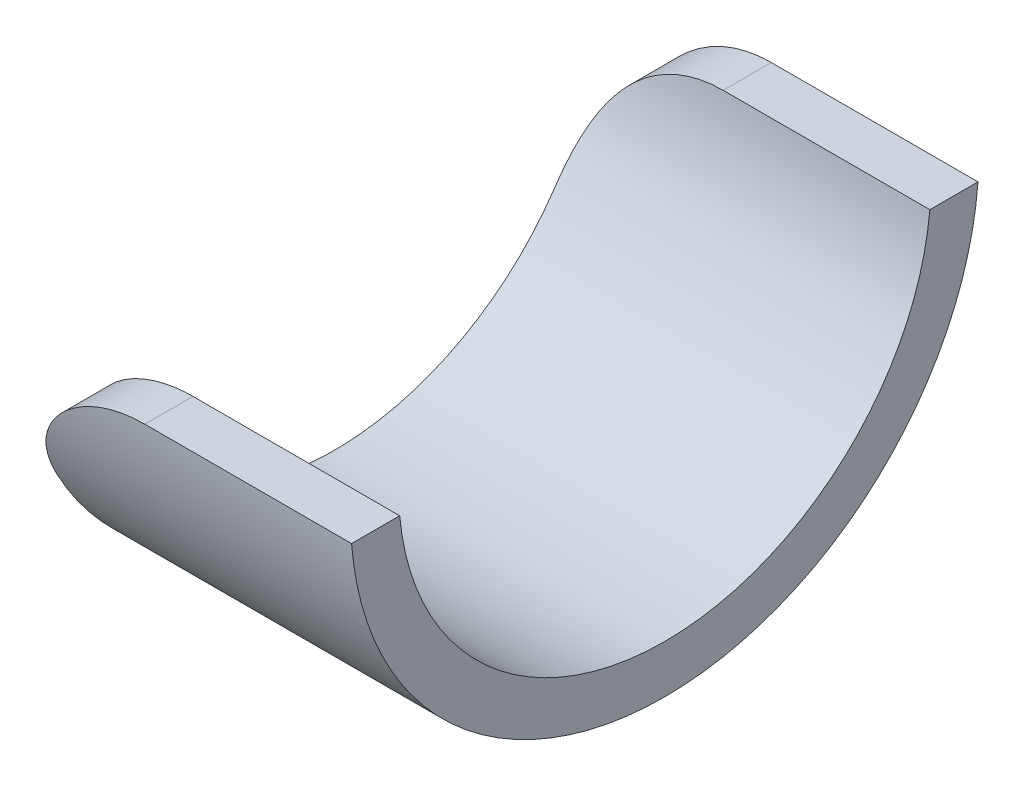
ISO-10303-21;
HEADER;
FILE_DESCRIPTION(('STEP AP214'),'2;1');
FILE_NAME('part.step','',(''),(''),'','','');
FILE_SCHEMA(('AUTOMOTIVE_DESIGN { 1 0 10303 214 1 1 1 1 }'));
ENDSEC;
DATA;
#1=APPLICATION_CONTEXT('core data for automotive mechanical design processes');
#2=APPLICATION_PROTOCOL_DEFINITION('international standard','automotive_design',2000,#1);
#3=PRODUCT_CONTEXT('',#1,'mechanical');
#4=PRODUCT('Part','Part','',(#3));
#5=PRODUCT_RELATED_PRODUCT_CATEGORY('part','',(#4));
#6=PRODUCT_DEFINITION_FORMATION('','',#4);
#7=PRODUCT_DEFINITION_CONTEXT('part definition',#1,'design');
#8=PRODUCT_DEFINITION('design','',#6,#7);
#9=PRODUCT_DEFINITION_SHAPE('','',#8);
#10=(LENGTH_UNIT() NAMED_UNIT(*) SI_UNIT(.MILLI.,.METRE.));
#11=(NAMED_UNIT(*) PLANE_ANGLE_UNIT() SI_UNIT($,.RADIAN.));
#12=(NAMED_UNIT(*) SI_UNIT($,.STERADIAN.) SOLID_ANGLE_UNIT());
#13=UNCERTAINTY_MEASURE_WITH_UNIT(LENGTH_MEASURE(1.E-05),#10,'distance_accuracy_value','');
#14=(GEOMETRIC_REPRESENTATION_CONTEXT(3) GLOBAL_UNCERTAINTY_ASSIGNED_CONTEXT((#13)) GLOBAL_UNIT_ASSIGNED_CONTEXT((#10,
#11,#12)) REPRESENTATION_CONTEXT('',''));
#15=CARTESIAN_POINT('',(0.,0.,0.));
#16=DIRECTION('',(0.,0.,1.));
#17=DIRECTION('',(1.,0.,0.));
#18=AXIS2_PLACEMENT_3D('',#15,#16,#17);
#19=CARTESIAN_POINT('',(25.4,0.,0.));
#20=DIRECTION('',(-1.,0.,0.));
#21=DIRECTION('',(0.,0.,1.));
#22=AXIS2_PLACEMENT_3D('',#19,#20,#21);
#23=CYLINDRICAL_SURFACE('',#22,24.13);
#24=CARTESIAN_POINT('',(0.,0.,0.));
#25=DIRECTION('',(1.,0.,0.));
#26=DIRECTION('',(0.,0.,-1.));
#27=AXIS2_PLACEMENT_3D('',#24,#25,#26);
#28=CIRCLE('',#27,24.13);
#29=CARTESIAN_POINT('',(0.,-11.43,21.2511646739655));
#30=VERTEX_POINT('',#29);
#31=CARTESIAN_POINT('',(0.,-11.43,-21.2511646739655));
#32=VERTEX_POINT('',#31);
#33=EDGE_CURVE('E165',#30,#32,#28,.T.);
#34=ORIENTED_EDGE('',*,*,#33,.T.);
#35=CARTESIAN_POINT('',(0.,-11.43,-21.2511646739655));
#36=CARTESIAN_POINT('',(-2.62243007126413E-05,-11.1860224640543,-21.3824335393108));
#37=CARTESIAN_POINT('',(0.00937477308694025,-10.9396845502003,-21.5094658719944));
#38=CARTESIAN_POINT('',(0.0479236395877504,-10.4439055163118,-21.7544876609394));
#39=CARTESIAN_POINT('',(0.0770830725086785,-10.1944626630503,-21.8724717766096));
#40=CARTESIAN_POINT('',(0.156118837118842,-9.69390311880306,-22.0988883031836));
#41=CARTESIAN_POINT('',(0.206034677985443,-9.44278413916173,-22.2073020174487));
#42=CARTESIAN_POINT('',(0.327202368802155,-8.94150477192952,-22.4138311063666));
#43=CARTESIAN_POINT('',(0.398449861662112,-8.69134419913753,-22.5119485785534));
#44=CARTESIAN_POINT('',(0.562964102877934,-8.19324315777415,-22.6979873973509));
#45=CARTESIAN_POINT('',(0.656316560719896,-7.94531533145705,-22.7858670176028));
#46=CARTESIAN_POINT('',(0.864917743170024,-7.45513554205446,-22.9509202864259));
#47=CARTESIAN_POINT('',(0.980168085088761,-7.21288399968737,-23.0280931434996));
#48=CARTESIAN_POINT('',(1.23201910546764,-6.73697795539725,-23.1717872843801));
#49=CARTESIAN_POINT('',(1.36858542185224,-6.50331035205277,-23.238325368346));
#50=CARTESIAN_POINT('',(1.66250238886438,-6.04664831564512,-23.3613112980713));
#51=CARTESIAN_POINT('',(1.81985155894157,-5.82365312382992,-23.4177598619249));
#52=CARTESIAN_POINT('',(2.14347109553134,-5.40470991060296,-23.5178520749754));
#53=CARTESIAN_POINT('',(2.3085037041298,-5.20794553211169,-23.562088255933));
#54=CARTESIAN_POINT('',(2.65479050631666,-4.82757709066209,-23.6429526368408));
#55=CARTESIAN_POINT('',(2.83604409448118,-4.64397253699317,-23.6795811205675));
#56=CARTESIAN_POINT('',(3.21363852043108,-4.29143598197451,-23.7460034791518));
#57=CARTESIAN_POINT('',(3.40998739998141,-4.12251190492314,-23.7757936768714));
#58=CARTESIAN_POINT('',(3.81630838261891,-3.80087139049984,-23.8293278664702));
#59=CARTESIAN_POINT('',(4.02628051460483,-3.64815498751076,-23.8530718455232));
#60=CARTESIAN_POINT('',(4.45704285565434,-3.36104542848596,-23.895213047223));
#61=CARTESIAN_POINT('',(4.67775947309696,-3.22654644377813,-23.9136419215247));
#62=CARTESIAN_POINT('',(5.12964311440567,-2.97581587645182,-23.9461355713094));
#63=CARTESIAN_POINT('',(5.36081023917931,-2.85958447026916,-23.960200304643));
#64=CARTESIAN_POINT('',(5.831928095831,-2.64628232956131,-23.9846954693647));
#65=CARTESIAN_POINT('',(6.07187653555342,-2.54920663658397,-23.9951268417838));
#66=CARTESIAN_POINT('',(6.55895637291033,-2.37488541721316,-24.0130070257699));
#67=CARTESIAN_POINT('',(6.80608684064031,-2.29763733623003,-24.0204562216298));
#68=CARTESIAN_POINT('',(7.25703859547032,-2.17660389124137,-24.0316919659944));
#69=CARTESIAN_POINT('',(7.45989511606065,-2.12922984902613,-24.0359096588211));
#70=CARTESIAN_POINT('',(7.86827969905803,-2.04787644322711,-24.0429774229925));
#71=CARTESIAN_POINT('',(8.07380739515986,-2.0138952626542,-24.0458276798666));
#72=CARTESIAN_POINT('',(8.48648285909893,-1.95949981658252,-24.0503232209338));
#73=CARTESIAN_POINT('',(8.69362909932989,-1.93907402968682,-24.0519695285443));
#74=CARTESIAN_POINT('',(9.10884950593469,-1.9118178800914,-24.0541447550348));
#75=CARTESIAN_POINT('',(9.31692380045259,-1.90498945704754,-24.0546735144979));
#76=CARTESIAN_POINT('',(9.525,-1.905,-24.0546850945923));
#77=B_SPLINE_CURVE_WITH_KNOTS('',3,(#35,#36,#37,#38,#39,#40,#41,#42,#43,#44,#45,#46,#47,#48,#49,
#50,#51,#52,#53,#54,#55,#56,#57,#58,#59,#60,#61,#62,#63,#64,#65,#66,#67,#68,#69,#70,#71,#72,#73,
#74,#75,#76),.UNSPECIFIED.,.F.,.F.,(4,2,2,2,2,2,2,2,2,2,2,2,2,2,2,2,2,2,2,2,4),(0.,
0.831053790770307,1.66259438406464,2.49572508742816,3.32868573588827,4.16493056434458,
5.0012371793046,5.83620930417523,6.67112197849129,7.45196225401338,8.23277339798149,
9.01400342752858,9.79523511433871,10.5717136526312,11.3481996900133,12.1244844697337,
12.9006691826562,13.5253091224103,14.1498642890198,14.7738879332271,15.3980005876607),.UNSPECIFIED.);
#78=CARTESIAN_POINT('',(9.525,-1.905,-24.0546850945923));
#79=VERTEX_POINT('',#78);
#80=EDGE_CURVE('E43',#32,#79,#77,.T.);
#81=ORIENTED_EDGE('',*,*,#80,.T.);
#82=DIRECTION('',(-1.,0.,0.));
#83=VECTOR('',#82,1.);
#84=CARTESIAN_POINT('',(25.4,-1.905,-24.0546850945923));
#85=LINE('',#84,#83);
#86=CARTESIAN_POINT('',(25.4,-1.905,-24.0546850945923));
#87=VERTEX_POINT('',#86);
#88=EDGE_CURVE('E95',#87,#79,#85,.T.);
#89=ORIENTED_EDGE('',*,*,#88,.F.);
#90=CARTESIAN_POINT('',(25.4,0.,0.));
#91=DIRECTION('',(1.,0.,0.));
#92=DIRECTION('',(0.,0.,-1.));
#93=AXIS2_PLACEMENT_3D('',#90,#91,#92);
#94=CIRCLE('',#93,24.13);
#95=CARTESIAN_POINT('',(25.4,-1.905,24.0546850945923));
#96=VERTEX_POINT('',#95);
#97=EDGE_CURVE('E102',#96,#87,#94,.T.);
#98=ORIENTED_EDGE('',*,*,#97,.F.);
#99=DIRECTION('',(-1.,0.,0.));
#100=VECTOR('',#99,1.);
#101=CARTESIAN_POINT('',(25.4,-1.905,24.0546850945923));
#102=LINE('',#101,#100);
#103=CARTESIAN_POINT('',(9.525,-1.905,24.0546850945923));
#104=VERTEX_POINT('',#103);
#105=EDGE_CURVE('E184',#96,#104,#102,.T.);
#106=ORIENTED_EDGE('',*,*,#105,.T.);
#107=CARTESIAN_POINT('',(9.525,-1.905,24.0546850945923));
#108=CARTESIAN_POINT('',(9.25902855860662,-1.90497112249098,24.0546543706783));
#109=CARTESIAN_POINT('',(8.99305996792605,-1.91613908815105,24.0538018907344));
#110=CARTESIAN_POINT('',(8.46300387273561,-1.9606612994031,24.0502314004206));
#111=CARTESIAN_POINT('',(8.1989163303127,-1.99401509654734,24.0475134277582));
#112=CARTESIAN_POINT('',(7.67456650786336,-2.08268810274374,24.0399910936523));
#113=CARTESIAN_POINT('',(7.41430308962371,-2.1380006327919,24.0351873665735));
#114=CARTESIAN_POINT('',(6.89937138401652,-2.2701777631287,24.0230644040504));
#115=CARTESIAN_POINT('',(6.6447029998715,-2.34704199031998,24.0157452121526));
#116=CARTESIAN_POINT('',(6.14260206552165,-2.52181707329971,23.9980216823762));
#117=CARTESIAN_POINT('',(5.89517469334633,-2.61974259140439,23.9876151932781));
#118=CARTESIAN_POINT('',(5.40953230749561,-2.83586324053376,23.9630257307452));
#119=CARTESIAN_POINT('',(5.17131717562001,-2.9540581113811,23.9488428057835));
#120=CARTESIAN_POINT('',(4.70588661033124,-3.20976539159897,23.9159133288637));
#121=CARTESIAN_POINT('',(4.47866874681592,-3.34727350681213,23.8971677906916));
#122=CARTESIAN_POINT('',(4.03685190596719,-3.64051036300694,23.8542560267361));
#123=CARTESIAN_POINT('',(3.82225273297257,-3.79623882135804,23.8300898850306));
#124=CARTESIAN_POINT('',(3.40913310360506,-4.12311644738061,23.7757019327644));
#125=CARTESIAN_POINT('',(3.21048485846543,-4.29411352349554,23.7455368268045));
#126=CARTESIAN_POINT('',(2.82856447170116,-4.65123007876344,23.6781748356056));
#127=CARTESIAN_POINT('',(2.64529225956836,-4.8373494885639,23.6409779826139));
#128=CARTESIAN_POINT('',(2.29548581756171,-5.22294907941939,23.5587888909164));
#129=CARTESIAN_POINT('',(2.12894399446347,-5.42242313023072,23.5138002140805));
#130=CARTESIAN_POINT('',(1.81359856584554,-5.83295582002549,23.4153383321293));
#131=CARTESIAN_POINT('',(1.6647945124326,-6.04401416629933,23.3618653413296));
#132=CARTESIAN_POINT('',(1.38874855215797,-6.47113711214399,23.2471317644862));
#133=CARTESIAN_POINT('',(1.26111596507832,-6.68700031712436,23.1860605993367));
#134=CARTESIAN_POINT('',(1.02423098390503,-7.12596104699,23.0549352631465));
#135=CARTESIAN_POINT('',(0.914978750332491,-7.34905863503499,22.9848810136632));
#136=CARTESIAN_POINT('',(0.715071957252479,-7.80069709441672,22.8355565811858));
#137=CARTESIAN_POINT('',(0.624434549431874,-8.02924277118396,22.7562780033086));
#138=CARTESIAN_POINT('',(0.461930113313286,-8.48959759740636,22.5885730040502));
#139=CARTESIAN_POINT('',(0.390061506300686,-8.72140647065202,22.5001473529379));
#140=CARTESIAN_POINT('',(0.271603413772416,-9.16141574281794,22.3243212812767));
#141=CARTESIAN_POINT('',(0.223127464472969,-9.36947657204716,22.2378315842086));
#142=CARTESIAN_POINT('',(0.140643449883782,-9.7854805725289,22.0579381550127));
#143=CARTESIAN_POINT('',(0.106635777848727,-9.99342374042991,21.9645342350342));
#144=CARTESIAN_POINT('',(0.0527401220690146,-10.4075477143405,21.771354509249));
#145=CARTESIAN_POINT('',(0.0328187663108996,-10.6137315346706,21.6715943779708));
#146=CARTESIAN_POINT('',(0.00644491721495352,-11.0238100019182,21.4659113001518));
#147=CARTESIAN_POINT('',(-1.12453408408947E-05,-11.2277052573949,21.3599900405856));
#148=CARTESIAN_POINT('',(0.,-11.43,21.2511646739655));
#149=B_SPLINE_CURVE_WITH_KNOTS('',3,(#107,#108,#109,#110,#111,#112,#113,#114,#115,#116,#117,
#118,#119,#120,#121,#122,#123,#124,#125,#126,#127,#128,#129,#130,#131,#132,#133,#134,#135,#136,
#137,#138,#139,#140,#141,#142,#143,#144,#145,#146,#147,#148),.UNSPECIFIED.,.F.,.F.,(4,2,2,2,2,2,
2,2,2,2,2,2,2,2,2,2,2,2,2,2,4),(0.,0.797674807200183,1.59533349129078,2.39274974387176,
3.19015219264293,3.98811157936095,4.78606072424157,5.58383273105668,6.38159236462163,
7.17214191497642,7.96268783999794,8.75287333268876,9.54303886831846,10.316430031771,
11.0898279491281,11.8639353089751,12.6379775347455,13.3288503903548,14.0197420230188,
14.7089913240004,15.3980527824104),.UNSPECIFIED.);
#150=EDGE_CURVE('E50',#104,#30,#149,.T.);
#151=ORIENTED_EDGE('',*,*,#150,.T.);
#152=EDGE_LOOP('',(#34,#81,#89,#98,#106,#151));
#153=FACE_BOUND('',#152,.T.);
#154=ADVANCED_FACE('F34',(#153),#23,.T.);
#155=CARTESIAN_POINT('',(25.4,-1.905,-20.3580643480661));
#156=DIRECTION('',(0.,-1.,0.));
#157=DIRECTION('',(0.,0.,-1.));
#158=AXIS2_PLACEMENT_3D('',#155,#156,#157);
#159=PLANE('',#158);
#160=ORIENTED_EDGE('',*,*,#88,.T.);
#161=DIRECTION('',(0.,0.,1.));
#162=VECTOR('',#161,1.);
#163=CARTESIAN_POINT('',(9.525,-1.905,-20.3580643480661));
#164=LINE('',#163,#162);
#165=CARTESIAN_POINT('',(9.525,-1.905,-20.3580643480661));
#166=VERTEX_POINT('',#165);
#167=EDGE_CURVE('E114',#79,#166,#164,.T.);
#168=ORIENTED_EDGE('',*,*,#167,.T.);
#169=DIRECTION('',(-1.,0.,0.));
#170=VECTOR('',#169,1.);
#171=CARTESIAN_POINT('',(25.4,-1.905,-20.3580643480661));
#172=LINE('',#171,#170);
#173=CARTESIAN_POINT('',(25.4,-1.905,-20.3580643480661));
#174=VERTEX_POINT('',#173);
#175=EDGE_CURVE('E98',#174,#166,#172,.T.);
#176=ORIENTED_EDGE('',*,*,#175,.F.);
#177=DIRECTION('',(0.,0.,1.));
#178=VECTOR('',#177,1.);
#179=CARTESIAN_POINT('',(25.4,-1.905,-20.3580643480661));
#180=LINE('',#179,#178);
#181=EDGE_CURVE('E90',#87,#174,#180,.T.);
#182=ORIENTED_EDGE('',*,*,#181,.F.);
#183=EDGE_LOOP('',(#160,#168,#176,#182));
#184=FACE_BOUND('',#183,.T.);
#185=ADVANCED_FACE('F92',(#184),#159,.F.);
#186=CARTESIAN_POINT('',(25.4,0.,0.));
#187=DIRECTION('',(-1.,0.,0.));
#188=DIRECTION('',(0.,0.,1.));
#189=AXIS2_PLACEMENT_3D('',#186,#187,#188);
#190=CYLINDRICAL_SURFACE('',#189,20.447);
#191=ORIENTED_EDGE('',*,*,#175,.T.);
#192=CARTESIAN_POINT('',(9.525,-1.905,-20.3580643480661));
#193=CARTESIAN_POINT('',(9.25978977014526,-1.90497110377044,-20.3580283743182));
#194=CARTESIAN_POINT('',(8.99458190205295,-1.91607541741178,-20.3570267347558));
#195=CARTESIAN_POINT('',(8.46603330595991,-1.96034336128463,-20.352832188804));
#196=CARTESIAN_POINT('',(8.20269256023756,-1.99350678186011,-20.3496393032408));
#197=CARTESIAN_POINT('',(7.67976710818044,-2.08168051639916,-20.3408028731761));
#198=CARTESIAN_POINT('',(7.42018195184562,-2.13668819010333,-20.3351596248361));
#199=CARTESIAN_POINT('',(6.9065823565463,-2.26813517562933,-20.3209194671558));
#200=CARTESIAN_POINT('',(6.65256781040154,-2.34457407471702,-20.312322614697));
#201=CARTESIAN_POINT('',(6.15172905872527,-2.51837915517059,-20.2915062917797));
#202=CARTESIAN_POINT('',(5.90491062304745,-2.61576163208616,-20.2792839976529));
#203=CARTESIAN_POINT('',(5.42046974204375,-2.83065885374987,-20.2504056126832));
#204=CARTESIAN_POINT('',(5.18284713201861,-2.94817323772638,-20.2337496012912));
#205=CARTESIAN_POINT('',(4.71860313323052,-3.20235227155138,-20.1950801117434));
#206=CARTESIAN_POINT('',(4.49197903223694,-3.33901216747872,-20.1730679625452));
#207=CARTESIAN_POINT('',(4.05136405145136,-3.63034088398203,-20.1226806227278));
#208=CARTESIAN_POINT('',(3.83737292244127,-3.78500934911329,-20.0943055576867));
#209=CARTESIAN_POINT('',(3.42620891630364,-4.10893379759801,-20.030560824482));
#210=CARTESIAN_POINT('',(3.22885954487623,-4.27798374878302,-19.9952828225731));
#211=CARTESIAN_POINT('',(2.84947281277147,-4.63073177356297,-19.9165452957226));
#212=CARTESIAN_POINT('',(2.66743532964771,-4.81442972999756,-19.8730858362156));
#213=CARTESIAN_POINT('',(2.32005992918782,-5.19456017598146,-19.7771267369428));
#214=CARTESIAN_POINT('',(2.15471065709082,-5.39098385541035,-19.724633310632));
#215=CARTESIAN_POINT('',(1.84162833815016,-5.79469430757571,-19.6098279166227));
#216=CARTESIAN_POINT('',(1.69389475833076,-6.00198075137795,-19.5475162461149));
#217=CARTESIAN_POINT('',(1.42089667288137,-6.41906899364777,-19.4144755131979));
#218=CARTESIAN_POINT('',(1.29510049382968,-6.62861897179975,-19.3440467118341));
#219=CARTESIAN_POINT('',(1.06130049022161,-7.05389488573657,-19.1930529525103));
#220=CARTESIAN_POINT('',(0.953296570547871,-7.26962078849771,-19.112488048742));
#221=CARTESIAN_POINT('',(0.755103699314461,-7.70549373801177,-18.9409635820805));
#222=CARTESIAN_POINT('',(0.664940401084745,-7.92564665685008,-18.8499893436497));
#223=CARTESIAN_POINT('',(0.50249570259122,-8.36804475355946,-18.6578079286869));
#224=CARTESIAN_POINT('',(0.430213517538051,-8.59028983916225,-18.5566012015262));
#225=CARTESIAN_POINT('',(0.303153739250019,-9.03487826701944,-18.3442481822495));
#226=CARTESIAN_POINT('',(0.248367946006984,-9.25722151419619,-18.23310657765));
#227=CARTESIAN_POINT('',(0.155607328845854,-9.70043791104361,-18.0012194838147));
#228=CARTESIAN_POINT('',(0.117635672778708,-9.92131077597413,-17.8804721898794));
#229=CARTESIAN_POINT('',(0.057778548534097,-10.3594428106769,-17.6302342348168));
#230=CARTESIAN_POINT('',(0.0358505781251143,-10.5767100272518,-17.5007676745597));
#231=CARTESIAN_POINT('',(0.00695864841239081,-11.0068892110165,-17.2334730625406));
#232=CARTESIAN_POINT('',(-1.40946185446643E-05,-11.2198036619075,-17.0956499678064));
#233=CARTESIAN_POINT('',(0.,-11.43,-16.9539054202859));
#234=B_SPLINE_CURVE_WITH_KNOTS('',3,(#192,#193,#194,#195,#196,#197,#198,#199,#200,#201,#202,
#203,#204,#205,#206,#207,#208,#209,#210,#211,#212,#213,#214,#215,#216,#217,#218,#219,#220,#221,
#222,#223,#224,#225,#226,#227,#228,#229,#230,#231,#232,#233),.UNSPECIFIED.,.F.,.F.,(4,2,2,2,2,2,
2,2,2,2,2,2,2,2,2,2,2,2,2,2,4),(0.,0.795393423654686,1.59077928777243,2.38606904486716,
3.18134348689319,3.97723896055609,4.77312017295292,5.5688041133931,6.3644723516572,
7.15021538340832,7.93595213111672,8.72115060258975,9.5063253112738,10.2684854549721,
11.0306415240326,11.7938856708571,12.5570963134924,13.319948736603,14.082944823085,
14.8439122217054,15.604432555074),.UNSPECIFIED.);
#235=CARTESIAN_POINT('',(0.,-11.43,-16.9539054202859));
#236=VERTEX_POINT('',#235);
#237=EDGE_CURVE('E128',#166,#236,#234,.T.);
#238=ORIENTED_EDGE('',*,*,#237,.T.);
#239=CARTESIAN_POINT('',(0.,0.,0.));
#240=DIRECTION('',(-1.,0.,0.));
#241=DIRECTION('',(0.,0.,-1.));
#242=AXIS2_PLACEMENT_3D('',#239,#240,#241);
#243=CIRCLE('',#242,20.447);
#244=CARTESIAN_POINT('',(0.,-11.43,16.9539054202859));
#245=VERTEX_POINT('',#244);
#246=EDGE_CURVE('E111',#236,#245,#243,.T.);
#247=ORIENTED_EDGE('',*,*,#246,.T.);
#248=CARTESIAN_POINT('',(0.,-11.43,16.9539054202859));
#249=CARTESIAN_POINT('',(-2.26556267190623E-05,-11.1970109347333,17.1110348965797));
#250=CARTESIAN_POINT('',(0.00854996527283876,-10.9606584924522,17.2633409521735));
#251=CARTESIAN_POINT('',(0.0441943253259937,-10.4827345096676,17.557631634213));
#252=CARTESIAN_POINT('',(0.0712805745076498,-10.241159019522,17.6996080681937));
#253=CARTESIAN_POINT('',(0.145377805371788,-9.75392492005596,17.9727321356884));
#254=CARTESIAN_POINT('',(0.192449364536353,-9.50825609668595,18.1038453856936));
#255=CARTESIAN_POINT('',(0.307566450309029,-9.01577956315671,18.3540664977231));
#256=CARTESIAN_POINT('',(0.375606449191654,-8.76897217001962,18.4731775128226));
#257=CARTESIAN_POINT('',(0.53383245903843,-8.27531248509759,18.6995490297245));
#258=CARTESIAN_POINT('',(0.624131647136172,-8.02846661678016,18.8067447749873));
#259=CARTESIAN_POINT('',(0.827078092665168,-7.53872313086899,19.0083559040058));
#260=CARTESIAN_POINT('',(0.939727382262767,-7.29582587447428,19.1027701242966));
#261=CARTESIAN_POINT('',(1.18702756275254,-6.81738744881128,19.2786895398164));
#262=CARTESIAN_POINT('',(1.32162936657595,-6.58183123312698,19.3602227547461));
#263=CARTESIAN_POINT('',(1.61248686004771,-6.12037421258529,19.5110161349573));
#264=CARTESIAN_POINT('',(1.76874040418349,-5.89447245394763,19.580277514731));
#265=CARTESIAN_POINT('',(2.08719310004087,-5.47451213954638,19.7015990829017));
#266=CARTESIAN_POINT('',(2.24764088450731,-5.27940511020473,19.7546393047696));
#267=CARTESIAN_POINT('',(2.58476100175011,-4.90138340496377,19.8518094278578));
#268=CARTESIAN_POINT('',(2.76143244282964,-4.71846805992848,19.8959398183609));
#269=CARTESIAN_POINT('',(3.12994468473486,-4.36644050139834,19.976151579886));
#270=CARTESIAN_POINT('',(3.32179551996768,-4.19733757130689,20.0122275652699));
#271=CARTESIAN_POINT('',(3.7192248194697,-3.87459604014138,20.0772114901172));
#272=CARTESIAN_POINT('',(3.92480339005321,-3.72095755885468,20.1061193740592));
#273=CARTESIAN_POINT('',(4.34587685286661,-3.43207667548693,20.1574291495039));
#274=CARTESIAN_POINT('',(4.56123652101523,-3.29664918935762,20.1798996243166));
#275=CARTESIAN_POINT('',(5.00256224098035,-3.04322714023593,20.2196697315629));
#276=CARTESIAN_POINT('',(5.22853303698627,-2.92524047465008,20.2369670251252));
#277=CARTESIAN_POINT('',(5.68939336395446,-2.7076913191788,20.2672218373143));
#278=CARTESIAN_POINT('',(5.92428109734117,-2.6081251394077,20.2801802255078));
#279=CARTESIAN_POINT('',(6.40133118829256,-2.42815162760385,20.3025150068543));
#280=CARTESIAN_POINT('',(6.64349011485936,-2.34773541457401,20.3118930616464));
#281=CARTESIAN_POINT('',(7.10242990400114,-2.21553591633533,20.3267077281063));
#282=CARTESIAN_POINT('',(7.31852976669072,-2.16141368417318,20.3324935680789));
#283=CARTESIAN_POINT('',(7.75401731871972,-2.06843955546321,20.3421616557291));
#284=CARTESIAN_POINT('',(7.97340471224863,-2.02958629348418,20.3460440736285));
#285=CARTESIAN_POINT('',(8.41426514810789,-1.96736786921801,20.352157279265));
#286=CARTESIAN_POINT('',(8.63573700720965,-1.94399440122065,20.3543889527872));
#287=CARTESIAN_POINT('',(9.0798052484316,-1.91280264393239,20.3573335916408));
#288=CARTESIAN_POINT('',(9.30240173911299,-1.9049858862538,20.358046407436));
#289=CARTESIAN_POINT('',(9.525,-1.905,20.3580643480661));
#290=B_SPLINE_CURVE_WITH_KNOTS('',3,(#248,#249,#250,#251,#252,#253,#254,#255,#256,#257,#258,
#259,#260,#261,#262,#263,#264,#265,#266,#267,#268,#269,#270,#271,#272,#273,#274,#275,#276,#277,
#278,#279,#280,#281,#282,#283,#284,#285,#286,#287,#288,#289),.UNSPECIFIED.,.F.,.F.,(4,2,2,2,2,2,
2,2,2,2,2,2,2,2,2,2,2,2,2,2,4),(0.,0.843012231859918,1.68668593203055,2.53293535688566,
3.37896188300092,4.22938213047316,5.07987973723859,5.92850102018458,6.77703827167067,
7.55044553476625,8.32381031468301,9.09769067222045,9.87157702376157,10.6368826673749,
11.4025337956783,12.1680313867012,12.9331732758271,13.6011795842373,14.2691261424273,
14.9367140217581,15.6043676241904),.UNSPECIFIED.);
#291=CARTESIAN_POINT('',(9.525,-1.905,20.3580643480661));
#292=VERTEX_POINT('',#291);
#293=EDGE_CURVE('E116',#245,#292,#290,.T.);
#294=ORIENTED_EDGE('',*,*,#293,.T.);
#295=DIRECTION('',(-1.,0.,0.));
#296=VECTOR('',#295,1.);
#297=CARTESIAN_POINT('',(25.4,-1.905,20.3580643480661));
#298=LINE('',#297,#296);
#299=CARTESIAN_POINT('',(25.4,-1.905,20.3580643480661));
#300=VERTEX_POINT('',#299);
#301=EDGE_CURVE('E118',#300,#292,#298,.T.);
#302=ORIENTED_EDGE('',*,*,#301,.F.);
#303=CARTESIAN_POINT('',(25.4,0.,0.));
#304=DIRECTION('',(-1.,0.,0.));
#305=DIRECTION('',(0.,0.,-1.));
#306=AXIS2_PLACEMENT_3D('',#303,#304,#305);
#307=CIRCLE('',#306,20.447);
#308=EDGE_CURVE('E101',#174,#300,#307,.T.);
#309=ORIENTED_EDGE('',*,*,#308,.F.);
#310=EDGE_LOOP('',(#191,#238,#247,#294,#302,#309));
#311=FACE_BOUND('',#310,.T.);
#312=ADVANCED_FACE('F134',(#311),#190,.F.);
#313=CARTESIAN_POINT('',(25.4,-1.905,24.0546850945923));
#314=DIRECTION('',(0.,-1.,0.));
#315=DIRECTION('',(0.,0.,-1.));
#316=AXIS2_PLACEMENT_3D('',#313,#314,#315);
#317=PLANE('',#316);
#318=ORIENTED_EDGE('',*,*,#301,.T.);
#319=DIRECTION('',(0.,0.,1.));
#320=VECTOR('',#319,1.);
#321=CARTESIAN_POINT('',(9.525,-1.905,24.0546850945923));
#322=LINE('',#321,#320);
#323=EDGE_CURVE('E11',#292,#104,#322,.T.);
#324=ORIENTED_EDGE('',*,*,#323,.T.);
#325=ORIENTED_EDGE('',*,*,#105,.F.);
#326=DIRECTION('',(0.,0.,1.));
#327=VECTOR('',#326,1.);
#328=CARTESIAN_POINT('',(25.4,-1.905,24.0546850945923));
#329=LINE('',#328,#327);
#330=EDGE_CURVE('E107',#300,#96,#329,.T.);
#331=ORIENTED_EDGE('',*,*,#330,.F.);
#332=EDGE_LOOP('',(#318,#324,#325,#331));
#333=FACE_BOUND('',#332,.T.);
#334=ADVANCED_FACE('F139',(#333),#317,.F.);
#335=CARTESIAN_POINT('',(25.4,0.,0.));
#336=DIRECTION('',(1.,0.,0.));
#337=DIRECTION('',(0.,0.,-1.));
#338=AXIS2_PLACEMENT_3D('',#335,#336,#337);
#339=PLANE('',#338);
#340=ORIENTED_EDGE('',*,*,#97,.T.);
#341=ORIENTED_EDGE('',*,*,#181,.T.);
#342=ORIENTED_EDGE('',*,*,#308,.T.);
#343=ORIENTED_EDGE('',*,*,#330,.T.);
#344=EDGE_LOOP('',(#340,#341,#342,#343));
#345=FACE_BOUND('',#344,.T.);
#346=ADVANCED_FACE('F105',(#345),#339,.T.);
#347=CARTESIAN_POINT('',(0.,0.,0.));
#348=DIRECTION('',(1.,0.,0.));
#349=DIRECTION('',(0.,0.,-1.));
#350=AXIS2_PLACEMENT_3D('',#347,#348,#349);
#351=PLANE('',#350);
#352=ORIENTED_EDGE('',*,*,#246,.F.);
#353=DIRECTION('',(0.,0.,1.));
#354=VECTOR('',#353,1.);
#355=CARTESIAN_POINT('',(0.,-11.43,0.));
#356=LINE('',#355,#354);
#357=EDGE_CURVE('E57',#236,#32,#356,.F.);
#358=ORIENTED_EDGE('',*,*,#357,.T.);
#359=ORIENTED_EDGE('',*,*,#33,.F.);
#360=DIRECTION('',(0.,0.,1.));
#361=VECTOR('',#360,1.);
#362=CARTESIAN_POINT('',(0.,-11.43,0.));
#363=LINE('',#362,#361);
#364=EDGE_CURVE('E160',#30,#245,#363,.F.);
#365=ORIENTED_EDGE('',*,*,#364,.T.);
#366=EDGE_LOOP('',(#352,#358,#359,#365));
#367=FACE_BOUND('',#366,.T.);
#368=ADVANCED_FACE('F164',(#367),#351,.F.);
#369=CARTESIAN_POINT('',(9.525,-11.43,-20.3580643480661));
#370=DIRECTION('',(0.,0.,1.));
#371=DIRECTION('',(1.,0.,0.));
#372=AXIS2_PLACEMENT_3D('',#369,#370,#371);
#373=CYLINDRICAL_SURFACE('',#372,9.525);
#374=ORIENTED_EDGE('',*,*,#80,.F.);
#375=ORIENTED_EDGE('',*,*,#357,.F.);
#376=ORIENTED_EDGE('',*,*,#237,.F.);
#377=ORIENTED_EDGE('',*,*,#167,.F.);
#378=EDGE_LOOP('',(#374,#375,#376,#377));
#379=FACE_BOUND('',#378,.T.);
#380=ADVANCED_FACE('F147',(#379),#373,.T.);
#381=CARTESIAN_POINT('',(9.525,-11.43,24.0546850945923));
#382=DIRECTION('',(0.,0.,1.));
#383=DIRECTION('',(1.,0.,0.));
#384=AXIS2_PLACEMENT_3D('',#381,#382,#383);
#385=CYLINDRICAL_SURFACE('',#384,9.525);
#386=ORIENTED_EDGE('',*,*,#293,.F.);
#387=ORIENTED_EDGE('',*,*,#364,.F.);
#388=ORIENTED_EDGE('',*,*,#150,.F.);
#389=ORIENTED_EDGE('',*,*,#323,.F.);
#390=EDGE_LOOP('',(#386,#387,#388,#389));
#391=FACE_BOUND('',#390,.T.);
#392=ADVANCED_FACE('F36',(#391),#385,.T.);
#393=CLOSED_SHELL('',(#154,#185,#312,#334,#346,#368,#380,#392));
#394=MANIFOLD_SOLID_BREP('B2',#393);
#395=ADVANCED_BREP_SHAPE_REPRESENTATION('',(#18,#394),#14);
#396=SHAPE_DEFINITION_REPRESENTATION(#9,#395);
ENDSEC;
END-ISO-10303-21;
